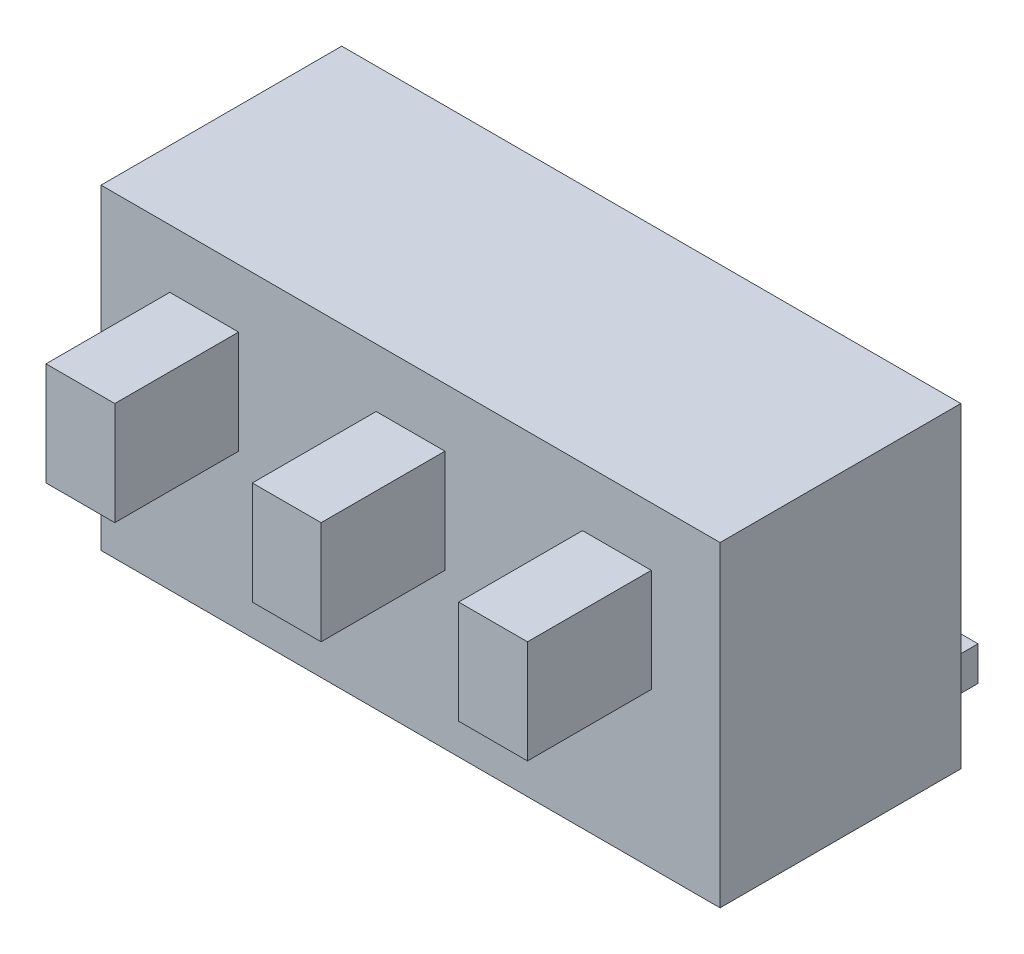
ISO-10303-21;
HEADER;
FILE_DESCRIPTION(('STEP AP214'),'2;1');
FILE_NAME('part.step','',(''),(''),'','','');
FILE_SCHEMA(('AUTOMOTIVE_DESIGN { 1 0 10303 214 1 1 1 1 }'));
ENDSEC;
DATA;
#1=APPLICATION_CONTEXT('core data for automotive mechanical design processes');
#2=APPLICATION_PROTOCOL_DEFINITION('international standard','automotive_design',2000,#1);
#3=PRODUCT_CONTEXT('',#1,'mechanical');
#4=PRODUCT('Part','Part','',(#3));
#5=PRODUCT_RELATED_PRODUCT_CATEGORY('part','',(#4));
#6=PRODUCT_DEFINITION_FORMATION('','',#4);
#7=PRODUCT_DEFINITION_CONTEXT('part definition',#1,'design');
#8=PRODUCT_DEFINITION('design','',#6,#7);
#9=PRODUCT_DEFINITION_SHAPE('','',#8);
#10=(LENGTH_UNIT() NAMED_UNIT(*) SI_UNIT(.MILLI.,.METRE.));
#11=(NAMED_UNIT(*) PLANE_ANGLE_UNIT() SI_UNIT($,.RADIAN.));
#12=(NAMED_UNIT(*) SI_UNIT($,.STERADIAN.) SOLID_ANGLE_UNIT());
#13=UNCERTAINTY_MEASURE_WITH_UNIT(LENGTH_MEASURE(1.E-05),#10,'distance_accuracy_value','');
#14=(GEOMETRIC_REPRESENTATION_CONTEXT(3) GLOBAL_UNCERTAINTY_ASSIGNED_CONTEXT((#13)) GLOBAL_UNIT_ASSIGNED_CONTEXT((#10,
#11,#12)) REPRESENTATION_CONTEXT('',''));
#15=CARTESIAN_POINT('',(0.,0.,0.));
#16=DIRECTION('',(0.,0.,1.));
#17=DIRECTION('',(1.,0.,0.));
#18=AXIS2_PLACEMENT_3D('',#15,#16,#17);
#19=CARTESIAN_POINT('',(-4.50000000000001,4.6,-1.75));
#20=DIRECTION('',(0.,0.,1.));
#21=DIRECTION('',(1.,0.,0.));
#22=AXIS2_PLACEMENT_3D('',#19,#20,#21);
#23=PLANE('',#22);
#24=DIRECTION('',(0.,1.,0.));
#25=VECTOR('',#24,1.);
#26=CARTESIAN_POINT('',(2.45,0.5,-1.75));
#27=LINE('',#26,#25);
#28=CARTESIAN_POINT('',(2.45,0.,-1.75));
#29=VERTEX_POINT('',#28);
#30=CARTESIAN_POINT('',(2.45,0.5,-1.75));
#31=VERTEX_POINT('',#30);
#32=EDGE_CURVE('E239',#29,#31,#27,.T.);
#33=ORIENTED_EDGE('',*,*,#32,.F.);
#34=DIRECTION('',(-1.,0.,0.));
#35=VECTOR('',#34,1.);
#36=CARTESIAN_POINT('',(-4.50000000000001,0.,-1.75));
#37=LINE('',#36,#35);
#38=CARTESIAN_POINT('',(0.55,0.,-1.75));
#39=VERTEX_POINT('',#38);
#40=EDGE_CURVE('E434',#29,#39,#37,.T.);
#41=ORIENTED_EDGE('',*,*,#40,.T.);
#42=DIRECTION('',(0.,-1.,0.));
#43=VECTOR('',#42,1.);
#44=CARTESIAN_POINT('',(0.55,0.5,-1.75));
#45=LINE('',#44,#43);
#46=CARTESIAN_POINT('',(0.55,0.5,-1.75));
#47=VERTEX_POINT('',#46);
#48=EDGE_CURVE('E280',#47,#39,#45,.T.);
#49=ORIENTED_EDGE('',*,*,#48,.F.);
#50=DIRECTION('',(1.,0.,0.));
#51=VECTOR('',#50,1.);
#52=CARTESIAN_POINT('',(0.55,0.5,-1.75));
#53=LINE('',#52,#51);
#54=CARTESIAN_POINT('',(-0.55,0.5,-1.75));
#55=VERTEX_POINT('',#54);
#56=EDGE_CURVE('E289',#55,#47,#53,.T.);
#57=ORIENTED_EDGE('',*,*,#56,.F.);
#58=DIRECTION('',(0.,1.,0.));
#59=VECTOR('',#58,1.);
#60=CARTESIAN_POINT('',(-0.55,0.5,-1.75));
#61=LINE('',#60,#59);
#62=CARTESIAN_POINT('',(-0.55,0.,-1.75));
#63=VERTEX_POINT('',#62);
#64=EDGE_CURVE('E275',#63,#55,#61,.T.);
#65=ORIENTED_EDGE('',*,*,#64,.F.);
#66=CARTESIAN_POINT('',(-2.45,0.,-1.75));
#67=VERTEX_POINT('',#66);
#68=EDGE_CURVE('E435',#63,#67,#37,.T.);
#69=ORIENTED_EDGE('',*,*,#68,.T.);
#70=DIRECTION('',(0.,-1.,0.));
#71=VECTOR('',#70,1.);
#72=CARTESIAN_POINT('',(-2.45,0.5,-1.75));
#73=LINE('',#72,#71);
#74=CARTESIAN_POINT('',(-2.45,0.5,-1.75));
#75=VERTEX_POINT('',#74);
#76=EDGE_CURVE('E253',#75,#67,#73,.T.);
#77=ORIENTED_EDGE('',*,*,#76,.F.);
#78=DIRECTION('',(1.,0.,0.));
#79=VECTOR('',#78,1.);
#80=CARTESIAN_POINT('',(-2.45,0.5,-1.75));
#81=LINE('',#80,#79);
#82=CARTESIAN_POINT('',(-3.55,0.5,-1.75));
#83=VERTEX_POINT('',#82);
#84=EDGE_CURVE('E243',#83,#75,#81,.T.);
#85=ORIENTED_EDGE('',*,*,#84,.F.);
#86=DIRECTION('',(0.,1.,0.));
#87=VECTOR('',#86,1.);
#88=CARTESIAN_POINT('',(-3.55,0.5,-1.75));
#89=LINE('',#88,#87);
#90=CARTESIAN_POINT('',(-3.55,0.,-1.75));
#91=VERTEX_POINT('',#90);
#92=EDGE_CURVE('E240',#91,#83,#89,.T.);
#93=ORIENTED_EDGE('',*,*,#92,.F.);
#94=CARTESIAN_POINT('',(-4.50000000000001,0.,-1.75));
#95=VERTEX_POINT('',#94);
#96=EDGE_CURVE('E430',#91,#95,#37,.T.);
#97=ORIENTED_EDGE('',*,*,#96,.T.);
#98=DIRECTION('',(0.,-1.,0.));
#99=VECTOR('',#98,1.);
#100=CARTESIAN_POINT('',(-4.50000000000001,4.6,-1.75));
#101=LINE('',#100,#99);
#102=CARTESIAN_POINT('',(-4.50000000000001,4.6,-1.75));
#103=VERTEX_POINT('',#102);
#104=EDGE_CURVE('E42',#103,#95,#101,.T.);
#105=ORIENTED_EDGE('',*,*,#104,.F.);
#106=DIRECTION('',(-1.,0.,0.));
#107=VECTOR('',#106,1.);
#108=CARTESIAN_POINT('',(-4.50000000000001,4.6,-1.75));
#109=LINE('',#108,#107);
#110=CARTESIAN_POINT('',(4.49999999999999,4.6,-1.75));
#111=VERTEX_POINT('',#110);
#112=EDGE_CURVE('E420',#111,#103,#109,.T.);
#113=ORIENTED_EDGE('',*,*,#112,.F.);
#114=DIRECTION('',(0.,-1.,0.));
#115=VECTOR('',#114,1.);
#116=CARTESIAN_POINT('',(4.49999999999999,4.6,-1.75));
#117=LINE('',#116,#115);
#118=CARTESIAN_POINT('',(4.49999999999999,0.,-1.75));
#119=VERTEX_POINT('',#118);
#120=EDGE_CURVE('E11',#111,#119,#117,.T.);
#121=ORIENTED_EDGE('',*,*,#120,.T.);
#122=CARTESIAN_POINT('',(3.55,0.,-1.75));
#123=VERTEX_POINT('',#122);
#124=EDGE_CURVE('E431',#119,#123,#37,.T.);
#125=ORIENTED_EDGE('',*,*,#124,.T.);
#126=DIRECTION('',(0.,-1.,0.));
#127=VECTOR('',#126,1.);
#128=CARTESIAN_POINT('',(3.55,0.5,-1.75));
#129=LINE('',#128,#127);
#130=CARTESIAN_POINT('',(3.55,0.5,-1.75));
#131=VERTEX_POINT('',#130);
#132=EDGE_CURVE('E54',#131,#123,#129,.T.);
#133=ORIENTED_EDGE('',*,*,#132,.F.);
#134=DIRECTION('',(1.,0.,0.));
#135=VECTOR('',#134,1.);
#136=CARTESIAN_POINT('',(3.55,0.5,-1.75));
#137=LINE('',#136,#135);
#138=EDGE_CURVE('E49',#31,#131,#137,.T.);
#139=ORIENTED_EDGE('',*,*,#138,.F.);
#140=EDGE_LOOP('',(#33,#41,#49,#57,#65,#69,#77,#85,#93,#97,#105,#113,#121,#125,#133,#139));
#141=FACE_BOUND('',#140,.T.);
#142=ADVANCED_FACE('F34',(#141),#23,.F.);
#143=CARTESIAN_POINT('',(-4.50000000000001,4.6,1.75));
#144=DIRECTION('',(0.,0.,-1.));
#145=DIRECTION('',(-1.,0.,0.));
#146=AXIS2_PLACEMENT_3D('',#143,#144,#145);
#147=PLANE('',#146);
#148=DIRECTION('',(0.,1.,0.));
#149=VECTOR('',#148,1.);
#150=CARTESIAN_POINT('',(3.5,2.25,1.75));
#151=LINE('',#150,#149);
#152=CARTESIAN_POINT('',(3.5,2.25,1.75));
#153=VERTEX_POINT('',#152);
#154=CARTESIAN_POINT('',(3.5,3.75,1.75));
#155=VERTEX_POINT('',#154);
#156=EDGE_CURVE('E380',#153,#155,#151,.T.);
#157=ORIENTED_EDGE('',*,*,#156,.F.);
#158=DIRECTION('',(1.,0.,0.));
#159=VECTOR('',#158,1.);
#160=CARTESIAN_POINT('',(2.5,2.25,1.75));
#161=LINE('',#160,#159);
#162=CARTESIAN_POINT('',(2.5,2.25,1.75));
#163=VERTEX_POINT('',#162);
#164=EDGE_CURVE('E350',#163,#153,#161,.T.);
#165=ORIENTED_EDGE('',*,*,#164,.F.);
#166=DIRECTION('',(0.,-1.,0.));
#167=VECTOR('',#166,1.);
#168=CARTESIAN_POINT('',(2.5,2.25,1.75));
#169=LINE('',#168,#167);
#170=CARTESIAN_POINT('',(2.5,3.75,1.75));
#171=VERTEX_POINT('',#170);
#172=EDGE_CURVE('E368',#171,#163,#169,.T.);
#173=ORIENTED_EDGE('',*,*,#172,.F.);
#174=DIRECTION('',(-1.,0.,0.));
#175=VECTOR('',#174,1.);
#176=CARTESIAN_POINT('',(2.5,3.75,1.75));
#177=LINE('',#176,#175);
#178=EDGE_CURVE('E374',#155,#171,#177,.T.);
#179=ORIENTED_EDGE('',*,*,#178,.F.);
#180=EDGE_LOOP('',(#157,#165,#173,#179));
#181=FACE_BOUND('',#180,.T.);
#182=DIRECTION('',(1.,0.,0.));
#183=VECTOR('',#182,1.);
#184=CARTESIAN_POINT('',(-4.50000000000001,0.,1.75));
#185=LINE('',#184,#183);
#186=CARTESIAN_POINT('',(-4.50000000000001,0.,1.75));
#187=VERTEX_POINT('',#186);
#188=CARTESIAN_POINT('',(4.49999999999999,0.,1.75));
#189=VERTEX_POINT('',#188);
#190=EDGE_CURVE('E421',#187,#189,#185,.T.);
#191=ORIENTED_EDGE('',*,*,#190,.T.);
#192=DIRECTION('',(0.,-1.,0.));
#193=VECTOR('',#192,1.);
#194=CARTESIAN_POINT('',(4.49999999999999,4.6,1.75));
#195=LINE('',#194,#193);
#196=CARTESIAN_POINT('',(4.49999999999999,4.6,1.75));
#197=VERTEX_POINT('',#196);
#198=EDGE_CURVE('E427',#197,#189,#195,.T.);
#199=ORIENTED_EDGE('',*,*,#198,.F.);
#200=DIRECTION('',(1.,0.,0.));
#201=VECTOR('',#200,1.);
#202=CARTESIAN_POINT('',(-4.50000000000001,4.6,1.75));
#203=LINE('',#202,#201);
#204=CARTESIAN_POINT('',(-4.50000000000001,4.6,1.75));
#205=VERTEX_POINT('',#204);
#206=EDGE_CURVE('E425',#205,#197,#203,.T.);
#207=ORIENTED_EDGE('',*,*,#206,.F.);
#208=DIRECTION('',(0.,-1.,0.));
#209=VECTOR('',#208,1.);
#210=CARTESIAN_POINT('',(-4.50000000000001,4.6,1.75));
#211=LINE('',#210,#209);
#212=EDGE_CURVE('E440',#205,#187,#211,.T.);
#213=ORIENTED_EDGE('',*,*,#212,.T.);
#214=EDGE_LOOP('',(#191,#199,#207,#213));
#215=FACE_BOUND('',#214,.T.);
#216=DIRECTION('',(0.,1.,0.));
#217=VECTOR('',#216,1.);
#218=CARTESIAN_POINT('',(0.5,2.25,1.75));
#219=LINE('',#218,#217);
#220=CARTESIAN_POINT('',(0.5,2.25,1.75));
#221=VERTEX_POINT('',#220);
#222=CARTESIAN_POINT('',(0.5,3.75,1.75));
#223=VERTEX_POINT('',#222);
#224=EDGE_CURVE('E383',#221,#223,#219,.T.);
#225=ORIENTED_EDGE('',*,*,#224,.F.);
#226=DIRECTION('',(1.,0.,0.));
#227=VECTOR('',#226,1.);
#228=CARTESIAN_POINT('',(-0.5,2.25,1.75));
#229=LINE('',#228,#227);
#230=CARTESIAN_POINT('',(-0.5,2.25,1.75));
#231=VERTEX_POINT('',#230);
#232=EDGE_CURVE('E388',#231,#221,#229,.T.);
#233=ORIENTED_EDGE('',*,*,#232,.F.);
#234=DIRECTION('',(0.,-1.,0.));
#235=VECTOR('',#234,1.);
#236=CARTESIAN_POINT('',(-0.5,2.25,1.75));
#237=LINE('',#236,#235);
#238=CARTESIAN_POINT('',(-0.499999999999999,3.75,1.75));
#239=VERTEX_POINT('',#238);
#240=EDGE_CURVE('E400',#239,#231,#237,.T.);
#241=ORIENTED_EDGE('',*,*,#240,.F.);
#242=DIRECTION('',(-1.,0.,0.));
#243=VECTOR('',#242,1.);
#244=CARTESIAN_POINT('',(-0.5,3.75,1.75));
#245=LINE('',#244,#243);
#246=EDGE_CURVE('E397',#223,#239,#245,.T.);
#247=ORIENTED_EDGE('',*,*,#246,.F.);
#248=EDGE_LOOP('',(#225,#233,#241,#247));
#249=FACE_BOUND('',#248,.T.);
#250=DIRECTION('',(0.,1.,0.));
#251=VECTOR('',#250,1.);
#252=CARTESIAN_POINT('',(-2.5,2.25,1.75));
#253=LINE('',#252,#251);
#254=CARTESIAN_POINT('',(-2.5,2.25,1.75));
#255=VERTEX_POINT('',#254);
#256=CARTESIAN_POINT('',(-2.5,3.75,1.75));
#257=VERTEX_POINT('',#256);
#258=EDGE_CURVE('E347',#255,#257,#253,.T.);
#259=ORIENTED_EDGE('',*,*,#258,.F.);
#260=DIRECTION('',(1.,0.,0.));
#261=VECTOR('',#260,1.);
#262=CARTESIAN_POINT('',(-3.5,2.25,1.75));
#263=LINE('',#262,#261);
#264=CARTESIAN_POINT('',(-3.5,2.25,1.75));
#265=VERTEX_POINT('',#264);
#266=EDGE_CURVE('E315',#265,#255,#263,.T.);
#267=ORIENTED_EDGE('',*,*,#266,.F.);
#268=DIRECTION('',(0.,-1.,0.));
#269=VECTOR('',#268,1.);
#270=CARTESIAN_POINT('',(-3.5,2.25,1.75));
#271=LINE('',#270,#269);
#272=CARTESIAN_POINT('',(-3.5,3.75,1.75));
#273=VERTEX_POINT('',#272);
#274=EDGE_CURVE('E335',#273,#265,#271,.T.);
#275=ORIENTED_EDGE('',*,*,#274,.F.);
#276=DIRECTION('',(-1.,0.,0.));
#277=VECTOR('',#276,1.);
#278=CARTESIAN_POINT('',(-3.5,3.75,1.75));
#279=LINE('',#278,#277);
#280=EDGE_CURVE('E341',#257,#273,#279,.T.);
#281=ORIENTED_EDGE('',*,*,#280,.F.);
#282=EDGE_LOOP('',(#259,#267,#275,#281));
#283=FACE_BOUND('',#282,.T.);
#284=ADVANCED_FACE('F457',(#181,#215,#249,#283),#147,.F.);
#285=CARTESIAN_POINT('',(4.49999999999999,4.6,1.75));
#286=DIRECTION('',(-1.,0.,0.));
#287=DIRECTION('',(0.,0.,1.));
#288=AXIS2_PLACEMENT_3D('',#285,#286,#287);
#289=PLANE('',#288);
#290=DIRECTION('',(0.,0.,-1.));
#291=VECTOR('',#290,1.);
#292=CARTESIAN_POINT('',(4.49999999999999,0.,1.75));
#293=LINE('',#292,#291);
#294=EDGE_CURVE('E416',#189,#119,#293,.T.);
#295=ORIENTED_EDGE('',*,*,#294,.T.);
#296=ORIENTED_EDGE('',*,*,#120,.F.);
#297=DIRECTION('',(0.,0.,-1.));
#298=VECTOR('',#297,1.);
#299=CARTESIAN_POINT('',(4.49999999999999,4.6,1.75));
#300=LINE('',#299,#298);
#301=EDGE_CURVE('E417',#197,#111,#300,.T.);
#302=ORIENTED_EDGE('',*,*,#301,.F.);
#303=ORIENTED_EDGE('',*,*,#198,.T.);
#304=EDGE_LOOP('',(#295,#296,#302,#303));
#305=FACE_BOUND('',#304,.T.);
#306=ADVANCED_FACE('F36',(#305),#289,.F.);
#307=CARTESIAN_POINT('',(-4.50000000000001,4.6,1.75));
#308=DIRECTION('',(1.,0.,0.));
#309=DIRECTION('',(0.,0.,-1.));
#310=AXIS2_PLACEMENT_3D('',#307,#308,#309);
#311=PLANE('',#310);
#312=DIRECTION('',(0.,0.,1.));
#313=VECTOR('',#312,1.);
#314=CARTESIAN_POINT('',(-4.50000000000001,0.,1.75));
#315=LINE('',#314,#313);
#316=EDGE_CURVE('E433',#95,#187,#315,.T.);
#317=ORIENTED_EDGE('',*,*,#316,.T.);
#318=ORIENTED_EDGE('',*,*,#212,.F.);
#319=DIRECTION('',(0.,0.,1.));
#320=VECTOR('',#319,1.);
#321=CARTESIAN_POINT('',(-4.50000000000001,4.6,1.75));
#322=LINE('',#321,#320);
#323=EDGE_CURVE('E423',#103,#205,#322,.T.);
#324=ORIENTED_EDGE('',*,*,#323,.F.);
#325=ORIENTED_EDGE('',*,*,#104,.T.);
#326=EDGE_LOOP('',(#317,#318,#324,#325));
#327=FACE_BOUND('',#326,.T.);
#328=ADVANCED_FACE('F447',(#327),#311,.F.);
#329=CARTESIAN_POINT('',(0.,4.6,0.));
#330=DIRECTION('',(0.,-1.,0.));
#331=DIRECTION('',(0.,0.,-1.));
#332=AXIS2_PLACEMENT_3D('',#329,#330,#331);
#333=PLANE('',#332);
#334=ORIENTED_EDGE('',*,*,#301,.T.);
#335=ORIENTED_EDGE('',*,*,#112,.T.);
#336=ORIENTED_EDGE('',*,*,#323,.T.);
#337=ORIENTED_EDGE('',*,*,#206,.T.);
#338=EDGE_LOOP('',(#334,#335,#336,#337));
#339=FACE_BOUND('',#338,.T.);
#340=ADVANCED_FACE('F464',(#339),#333,.F.);
#341=CARTESIAN_POINT('',(0.,0.,0.));
#342=DIRECTION('',(0.,-1.,0.));
#343=DIRECTION('',(0.,0.,-1.));
#344=AXIS2_PLACEMENT_3D('',#341,#342,#343);
#345=PLANE('',#344);
#346=CARTESIAN_POINT('',(1.5,0.,-1.15));
#347=DIRECTION('',(0.,-1.,0.));
#348=DIRECTION('',(0.,0.,-1.));
#349=AXIS2_PLACEMENT_3D('',#346,#347,#348);
#350=CIRCLE('',#349,0.35);
#351=CARTESIAN_POINT('',(1.5,0.,-1.5));
#352=VERTEX_POINT('',#351);
#353=EDGE_CURVE('E305',#352,#352,#350,.T.);
#354=ORIENTED_EDGE('',*,*,#353,.F.);
#355=EDGE_LOOP('',(#354));
#356=FACE_BOUND('',#355,.T.);
#357=CARTESIAN_POINT('',(-1.5,0.,-1.15));
#358=DIRECTION('',(0.,-1.,0.));
#359=DIRECTION('',(0.,0.,-1.));
#360=AXIS2_PLACEMENT_3D('',#357,#358,#359);
#361=CIRCLE('',#360,0.35);
#362=CARTESIAN_POINT('',(-1.5,0.,-1.5));
#363=VERTEX_POINT('',#362);
#364=EDGE_CURVE('E309',#363,#363,#361,.T.);
#365=ORIENTED_EDGE('',*,*,#364,.F.);
#366=EDGE_LOOP('',(#365));
#367=FACE_BOUND('',#366,.T.);
#368=ORIENTED_EDGE('',*,*,#294,.F.);
#369=ORIENTED_EDGE('',*,*,#190,.F.);
#370=ORIENTED_EDGE('',*,*,#316,.F.);
#371=ORIENTED_EDGE('',*,*,#96,.F.);
#372=DIRECTION('',(0.,0.,1.));
#373=VECTOR('',#372,1.);
#374=CARTESIAN_POINT('',(-3.55,0.,-2.95));
#375=LINE('',#374,#373);
#376=CARTESIAN_POINT('',(-3.55,0.,-2.95));
#377=VERTEX_POINT('',#376);
#378=EDGE_CURVE('E258',#377,#91,#375,.T.);
#379=ORIENTED_EDGE('',*,*,#378,.F.);
#380=DIRECTION('',(-1.,0.,0.));
#381=VECTOR('',#380,1.);
#382=CARTESIAN_POINT('',(-2.45,0.,-2.95));
#383=LINE('',#382,#381);
#384=CARTESIAN_POINT('',(-2.45,0.,-2.95));
#385=VERTEX_POINT('',#384);
#386=EDGE_CURVE('E257',#385,#377,#383,.T.);
#387=ORIENTED_EDGE('',*,*,#386,.F.);
#388=DIRECTION('',(0.,0.,1.));
#389=VECTOR('',#388,1.);
#390=CARTESIAN_POINT('',(-2.45,0.,-2.95));
#391=LINE('',#390,#389);
#392=EDGE_CURVE('E266',#385,#67,#391,.T.);
#393=ORIENTED_EDGE('',*,*,#392,.T.);
#394=ORIENTED_EDGE('',*,*,#68,.F.);
#395=DIRECTION('',(0.,0.,1.));
#396=VECTOR('',#395,1.);
#397=CARTESIAN_POINT('',(-0.55,0.,-2.95));
#398=LINE('',#397,#396);
#399=CARTESIAN_POINT('',(-0.55,0.,-2.95));
#400=VERTEX_POINT('',#399);
#401=EDGE_CURVE('E286',#400,#63,#398,.T.);
#402=ORIENTED_EDGE('',*,*,#401,.F.);
#403=DIRECTION('',(-1.,0.,0.));
#404=VECTOR('',#403,1.);
#405=CARTESIAN_POINT('',(0.55,0.,-2.95));
#406=LINE('',#405,#404);
#407=CARTESIAN_POINT('',(0.55,0.,-2.95));
#408=VERTEX_POINT('',#407);
#409=EDGE_CURVE('E284',#408,#400,#406,.T.);
#410=ORIENTED_EDGE('',*,*,#409,.F.);
#411=DIRECTION('',(0.,0.,1.));
#412=VECTOR('',#411,1.);
#413=CARTESIAN_POINT('',(0.55,0.,-2.95));
#414=LINE('',#413,#412);
#415=EDGE_CURVE('E296',#408,#39,#414,.T.);
#416=ORIENTED_EDGE('',*,*,#415,.T.);
#417=ORIENTED_EDGE('',*,*,#40,.F.);
#418=DIRECTION('',(0.,0.,1.));
#419=VECTOR('',#418,1.);
#420=CARTESIAN_POINT('',(2.45,0.,-2.95));
#421=LINE('',#420,#419);
#422=CARTESIAN_POINT('',(2.45,0.,-2.95));
#423=VERTEX_POINT('',#422);
#424=EDGE_CURVE('E470',#423,#29,#421,.T.);
#425=ORIENTED_EDGE('',*,*,#424,.F.);
#426=DIRECTION('',(-1.,0.,0.));
#427=VECTOR('',#426,1.);
#428=CARTESIAN_POINT('',(3.55,0.,-2.95));
#429=LINE('',#428,#427);
#430=CARTESIAN_POINT('',(3.55,0.,-2.95));
#431=VERTEX_POINT('',#430);
#432=EDGE_CURVE('E233',#431,#423,#429,.T.);
#433=ORIENTED_EDGE('',*,*,#432,.F.);
#434=DIRECTION('',(0.,0.,1.));
#435=VECTOR('',#434,1.);
#436=CARTESIAN_POINT('',(3.55,0.,-2.95));
#437=LINE('',#436,#435);
#438=EDGE_CURVE('E245',#431,#123,#437,.T.);
#439=ORIENTED_EDGE('',*,*,#438,.T.);
#440=ORIENTED_EDGE('',*,*,#124,.F.);
#441=EDGE_LOOP('',(#368,#369,#370,#371,#379,#387,#393,#394,#402,#410,#416,#417,#425,#433,#439,#440));
#442=FACE_BOUND('',#441,.T.);
#443=ADVANCED_FACE('F452',(#356,#367,#442),#345,.T.);
#444=CARTESIAN_POINT('',(0.5,2.25,3.55));
#445=DIRECTION('',(-1.,0.,0.));
#446=DIRECTION('',(0.,-1.,0.));
#447=AXIS2_PLACEMENT_3D('',#444,#445,#446);
#448=PLANE('',#447);
#449=ORIENTED_EDGE('',*,*,#224,.T.);
#450=DIRECTION('',(0.,0.,-1.));
#451=VECTOR('',#450,1.);
#452=CARTESIAN_POINT('',(0.5,3.75,3.55));
#453=LINE('',#452,#451);
#454=CARTESIAN_POINT('',(0.5,3.75,3.55));
#455=VERTEX_POINT('',#454);
#456=EDGE_CURVE('E413',#455,#223,#453,.T.);
#457=ORIENTED_EDGE('',*,*,#456,.F.);
#458=DIRECTION('',(0.,1.,0.));
#459=VECTOR('',#458,1.);
#460=CARTESIAN_POINT('',(0.5,2.25,3.55));
#461=LINE('',#460,#459);
#462=CARTESIAN_POINT('',(0.5,2.25,3.55));
#463=VERTEX_POINT('',#462);
#464=EDGE_CURVE('E384',#463,#455,#461,.T.);
#465=ORIENTED_EDGE('',*,*,#464,.F.);
#466=DIRECTION('',(0.,0.,-1.));
#467=VECTOR('',#466,1.);
#468=CARTESIAN_POINT('',(0.5,2.25,3.55));
#469=LINE('',#468,#467);
#470=EDGE_CURVE('E394',#463,#221,#469,.T.);
#471=ORIENTED_EDGE('',*,*,#470,.T.);
#472=EDGE_LOOP('',(#449,#457,#465,#471));
#473=FACE_BOUND('',#472,.T.);
#474=ADVANCED_FACE('F513',(#473),#448,.F.);
#475=CARTESIAN_POINT('',(-0.5,3.75,3.55));
#476=DIRECTION('',(0.,-1.,0.));
#477=DIRECTION('',(0.,0.,-1.));
#478=AXIS2_PLACEMENT_3D('',#475,#476,#477);
#479=PLANE('',#478);
#480=ORIENTED_EDGE('',*,*,#246,.T.);
#481=DIRECTION('',(0.,0.,-1.));
#482=VECTOR('',#481,1.);
#483=CARTESIAN_POINT('',(-0.5,3.75,3.55));
#484=LINE('',#483,#482);
#485=CARTESIAN_POINT('',(-0.5,3.75,3.55));
#486=VERTEX_POINT('',#485);
#487=EDGE_CURVE('E410',#486,#239,#484,.T.);
#488=ORIENTED_EDGE('',*,*,#487,.F.);
#489=DIRECTION('',(-1.,0.,0.));
#490=VECTOR('',#489,1.);
#491=CARTESIAN_POINT('',(-0.5,3.75,3.55));
#492=LINE('',#491,#490);
#493=EDGE_CURVE('E387',#455,#486,#492,.T.);
#494=ORIENTED_EDGE('',*,*,#493,.F.);
#495=ORIENTED_EDGE('',*,*,#456,.T.);
#496=EDGE_LOOP('',(#480,#488,#494,#495));
#497=FACE_BOUND('',#496,.T.);
#498=ADVANCED_FACE('F519',(#497),#479,.F.);
#499=CARTESIAN_POINT('',(-0.5,2.25,3.55));
#500=DIRECTION('',(1.,0.,0.));
#501=DIRECTION('',(0.,1.,0.));
#502=AXIS2_PLACEMENT_3D('',#499,#500,#501);
#503=PLANE('',#502);
#504=ORIENTED_EDGE('',*,*,#240,.T.);
#505=DIRECTION('',(0.,0.,-1.));
#506=VECTOR('',#505,1.);
#507=CARTESIAN_POINT('',(-0.5,2.25,3.55));
#508=LINE('',#507,#506);
#509=CARTESIAN_POINT('',(-0.5,2.25,3.55));
#510=VERTEX_POINT('',#509);
#511=EDGE_CURVE('E407',#510,#231,#508,.T.);
#512=ORIENTED_EDGE('',*,*,#511,.F.);
#513=DIRECTION('',(0.,-1.,0.));
#514=VECTOR('',#513,1.);
#515=CARTESIAN_POINT('',(-0.5,2.25,3.55));
#516=LINE('',#515,#514);
#517=EDGE_CURVE('E390',#486,#510,#516,.T.);
#518=ORIENTED_EDGE('',*,*,#517,.F.);
#519=ORIENTED_EDGE('',*,*,#487,.T.);
#520=EDGE_LOOP('',(#504,#512,#518,#519));
#521=FACE_BOUND('',#520,.T.);
#522=ADVANCED_FACE('F523',(#521),#503,.F.);
#523=CARTESIAN_POINT('',(-0.5,2.25,3.55));
#524=DIRECTION('',(0.,1.,0.));
#525=DIRECTION('',(0.,0.,1.));
#526=AXIS2_PLACEMENT_3D('',#523,#524,#525);
#527=PLANE('',#526);
#528=ORIENTED_EDGE('',*,*,#232,.T.);
#529=ORIENTED_EDGE('',*,*,#470,.F.);
#530=DIRECTION('',(1.,0.,0.));
#531=VECTOR('',#530,1.);
#532=CARTESIAN_POINT('',(-0.5,2.25,3.55));
#533=LINE('',#532,#531);
#534=EDGE_CURVE('E392',#510,#463,#533,.T.);
#535=ORIENTED_EDGE('',*,*,#534,.F.);
#536=ORIENTED_EDGE('',*,*,#511,.T.);
#537=EDGE_LOOP('',(#528,#529,#535,#536));
#538=FACE_BOUND('',#537,.T.);
#539=ADVANCED_FACE('F527',(#538),#527,.F.);
#540=CARTESIAN_POINT('',(0.,0.,3.55));
#541=DIRECTION('',(0.,0.,-1.));
#542=DIRECTION('',(-1.,0.,0.));
#543=AXIS2_PLACEMENT_3D('',#540,#541,#542);
#544=PLANE('',#543);
#545=ORIENTED_EDGE('',*,*,#464,.T.);
#546=ORIENTED_EDGE('',*,*,#493,.T.);
#547=ORIENTED_EDGE('',*,*,#517,.T.);
#548=ORIENTED_EDGE('',*,*,#534,.T.);
#549=EDGE_LOOP('',(#545,#546,#547,#548));
#550=FACE_BOUND('',#549,.T.);
#551=ADVANCED_FACE('F531',(#550),#544,.F.);
#552=CARTESIAN_POINT('',(3.5,2.25,3.55));
#553=DIRECTION('',(-1.,0.,0.));
#554=DIRECTION('',(0.,-1.,0.));
#555=AXIS2_PLACEMENT_3D('',#552,#553,#554);
#556=PLANE('',#555);
#557=ORIENTED_EDGE('',*,*,#156,.T.);
#558=DIRECTION('',(0.,0.,-1.));
#559=VECTOR('',#558,1.);
#560=CARTESIAN_POINT('',(3.5,3.75,3.55));
#561=LINE('',#560,#559);
#562=CARTESIAN_POINT('',(3.5,3.75,3.55));
#563=VERTEX_POINT('',#562);
#564=EDGE_CURVE('E377',#563,#155,#561,.T.);
#565=ORIENTED_EDGE('',*,*,#564,.F.);
#566=DIRECTION('',(0.,1.,0.));
#567=VECTOR('',#566,1.);
#568=CARTESIAN_POINT('',(3.5,2.25,3.55));
#569=LINE('',#568,#567);
#570=CARTESIAN_POINT('',(3.5,2.25,3.55));
#571=VERTEX_POINT('',#570);
#572=EDGE_CURVE('E353',#571,#563,#569,.T.);
#573=ORIENTED_EDGE('',*,*,#572,.F.);
#574=DIRECTION('',(0.,0.,-1.));
#575=VECTOR('',#574,1.);
#576=CARTESIAN_POINT('',(3.5,2.25,3.55));
#577=LINE('',#576,#575);
#578=EDGE_CURVE('E362',#571,#153,#577,.T.);
#579=ORIENTED_EDGE('',*,*,#578,.T.);
#580=EDGE_LOOP('',(#557,#565,#573,#579));
#581=FACE_BOUND('',#580,.T.);
#582=ADVANCED_FACE('F535',(#581),#556,.F.);
#583=CARTESIAN_POINT('',(2.5,3.75,3.55));
#584=DIRECTION('',(0.,-1.,0.));
#585=DIRECTION('',(0.,0.,-1.));
#586=AXIS2_PLACEMENT_3D('',#583,#584,#585);
#587=PLANE('',#586);
#588=ORIENTED_EDGE('',*,*,#178,.T.);
#589=DIRECTION('',(0.,0.,-1.));
#590=VECTOR('',#589,1.);
#591=CARTESIAN_POINT('',(2.5,3.75,3.55));
#592=LINE('',#591,#590);
#593=CARTESIAN_POINT('',(2.5,3.75,3.55));
#594=VERTEX_POINT('',#593);
#595=EDGE_CURVE('E371',#594,#171,#592,.T.);
#596=ORIENTED_EDGE('',*,*,#595,.F.);
#597=DIRECTION('',(-1.,0.,0.));
#598=VECTOR('',#597,1.);
#599=CARTESIAN_POINT('',(2.5,3.75,3.55));
#600=LINE('',#599,#598);
#601=EDGE_CURVE('E355',#563,#594,#600,.T.);
#602=ORIENTED_EDGE('',*,*,#601,.F.);
#603=ORIENTED_EDGE('',*,*,#564,.T.);
#604=EDGE_LOOP('',(#588,#596,#602,#603));
#605=FACE_BOUND('',#604,.T.);
#606=ADVANCED_FACE('F539',(#605),#587,.F.);
#607=CARTESIAN_POINT('',(2.5,2.25,3.55));
#608=DIRECTION('',(1.,0.,0.));
#609=DIRECTION('',(0.,1.,0.));
#610=AXIS2_PLACEMENT_3D('',#607,#608,#609);
#611=PLANE('',#610);
#612=ORIENTED_EDGE('',*,*,#172,.T.);
#613=DIRECTION('',(0.,0.,-1.));
#614=VECTOR('',#613,1.);
#615=CARTESIAN_POINT('',(2.5,2.25,3.55));
#616=LINE('',#615,#614);
#617=CARTESIAN_POINT('',(2.5,2.25,3.55));
#618=VERTEX_POINT('',#617);
#619=EDGE_CURVE('E365',#618,#163,#616,.T.);
#620=ORIENTED_EDGE('',*,*,#619,.F.);
#621=DIRECTION('',(0.,-1.,0.));
#622=VECTOR('',#621,1.);
#623=CARTESIAN_POINT('',(2.5,2.25,3.55));
#624=LINE('',#623,#622);
#625=EDGE_CURVE('E357',#594,#618,#624,.T.);
#626=ORIENTED_EDGE('',*,*,#625,.F.);
#627=ORIENTED_EDGE('',*,*,#595,.T.);
#628=EDGE_LOOP('',(#612,#620,#626,#627));
#629=FACE_BOUND('',#628,.T.);
#630=ADVANCED_FACE('F543',(#629),#611,.F.);
#631=CARTESIAN_POINT('',(2.5,2.25,3.55));
#632=DIRECTION('',(0.,1.,0.));
#633=DIRECTION('',(0.,0.,1.));
#634=AXIS2_PLACEMENT_3D('',#631,#632,#633);
#635=PLANE('',#634);
#636=ORIENTED_EDGE('',*,*,#164,.T.);
#637=ORIENTED_EDGE('',*,*,#578,.F.);
#638=DIRECTION('',(1.,0.,0.));
#639=VECTOR('',#638,1.);
#640=CARTESIAN_POINT('',(2.5,2.25,3.55));
#641=LINE('',#640,#639);
#642=EDGE_CURVE('E359',#618,#571,#641,.T.);
#643=ORIENTED_EDGE('',*,*,#642,.F.);
#644=ORIENTED_EDGE('',*,*,#619,.T.);
#645=EDGE_LOOP('',(#636,#637,#643,#644));
#646=FACE_BOUND('',#645,.T.);
#647=ADVANCED_FACE('F547',(#646),#635,.F.);
#648=CARTESIAN_POINT('',(3.,0.,3.55));
#649=DIRECTION('',(0.,0.,-1.));
#650=DIRECTION('',(-1.,0.,0.));
#651=AXIS2_PLACEMENT_3D('',#648,#649,#650);
#652=PLANE('',#651);
#653=ORIENTED_EDGE('',*,*,#572,.T.);
#654=ORIENTED_EDGE('',*,*,#601,.T.);
#655=ORIENTED_EDGE('',*,*,#625,.T.);
#656=ORIENTED_EDGE('',*,*,#642,.T.);
#657=EDGE_LOOP('',(#653,#654,#655,#656));
#658=FACE_BOUND('',#657,.T.);
#659=ADVANCED_FACE('F551',(#658),#652,.F.);
#660=CARTESIAN_POINT('',(-2.5,2.25,3.55));
#661=DIRECTION('',(-1.,0.,0.));
#662=DIRECTION('',(0.,-1.,0.));
#663=AXIS2_PLACEMENT_3D('',#660,#661,#662);
#664=PLANE('',#663);
#665=ORIENTED_EDGE('',*,*,#258,.T.);
#666=DIRECTION('',(0.,0.,-1.));
#667=VECTOR('',#666,1.);
#668=CARTESIAN_POINT('',(-2.5,3.75,3.55));
#669=LINE('',#668,#667);
#670=CARTESIAN_POINT('',(-2.5,3.75,3.55));
#671=VERTEX_POINT('',#670);
#672=EDGE_CURVE('E344',#671,#257,#669,.T.);
#673=ORIENTED_EDGE('',*,*,#672,.F.);
#674=DIRECTION('',(0.,1.,0.));
#675=VECTOR('',#674,1.);
#676=CARTESIAN_POINT('',(-2.5,2.25,3.55));
#677=LINE('',#676,#675);
#678=CARTESIAN_POINT('',(-2.5,2.25,3.55));
#679=VERTEX_POINT('',#678);
#680=EDGE_CURVE('E320',#679,#671,#677,.T.);
#681=ORIENTED_EDGE('',*,*,#680,.F.);
#682=DIRECTION('',(0.,0.,-1.));
#683=VECTOR('',#682,1.);
#684=CARTESIAN_POINT('',(-2.5,2.25,3.55));
#685=LINE('',#684,#683);
#686=EDGE_CURVE('E329',#679,#255,#685,.T.);
#687=ORIENTED_EDGE('',*,*,#686,.T.);
#688=EDGE_LOOP('',(#665,#673,#681,#687));
#689=FACE_BOUND('',#688,.T.);
#690=ADVANCED_FACE('F555',(#689),#664,.F.);
#691=CARTESIAN_POINT('',(-3.5,3.75,3.55));
#692=DIRECTION('',(0.,-1.,0.));
#693=DIRECTION('',(0.,0.,-1.));
#694=AXIS2_PLACEMENT_3D('',#691,#692,#693);
#695=PLANE('',#694);
#696=ORIENTED_EDGE('',*,*,#280,.T.);
#697=DIRECTION('',(0.,0.,-1.));
#698=VECTOR('',#697,1.);
#699=CARTESIAN_POINT('',(-3.5,3.75,3.55));
#700=LINE('',#699,#698);
#701=CARTESIAN_POINT('',(-3.5,3.75,3.55));
#702=VERTEX_POINT('',#701);
#703=EDGE_CURVE('E338',#702,#273,#700,.T.);
#704=ORIENTED_EDGE('',*,*,#703,.F.);
#705=DIRECTION('',(-1.,0.,0.));
#706=VECTOR('',#705,1.);
#707=CARTESIAN_POINT('',(-3.5,3.75,3.55));
#708=LINE('',#707,#706);
#709=EDGE_CURVE('E322',#671,#702,#708,.T.);
#710=ORIENTED_EDGE('',*,*,#709,.F.);
#711=ORIENTED_EDGE('',*,*,#672,.T.);
#712=EDGE_LOOP('',(#696,#704,#710,#711));
#713=FACE_BOUND('',#712,.T.);
#714=ADVANCED_FACE('F559',(#713),#695,.F.);
#715=CARTESIAN_POINT('',(-3.5,2.25,3.55));
#716=DIRECTION('',(1.,0.,0.));
#717=DIRECTION('',(0.,1.,0.));
#718=AXIS2_PLACEMENT_3D('',#715,#716,#717);
#719=PLANE('',#718);
#720=ORIENTED_EDGE('',*,*,#274,.T.);
#721=DIRECTION('',(0.,0.,-1.));
#722=VECTOR('',#721,1.);
#723=CARTESIAN_POINT('',(-3.5,2.25,3.55));
#724=LINE('',#723,#722);
#725=CARTESIAN_POINT('',(-3.5,2.25,3.55));
#726=VERTEX_POINT('',#725);
#727=EDGE_CURVE('E332',#726,#265,#724,.T.);
#728=ORIENTED_EDGE('',*,*,#727,.F.);
#729=DIRECTION('',(0.,-1.,0.));
#730=VECTOR('',#729,1.);
#731=CARTESIAN_POINT('',(-3.5,2.25,3.55));
#732=LINE('',#731,#730);
#733=EDGE_CURVE('E324',#702,#726,#732,.T.);
#734=ORIENTED_EDGE('',*,*,#733,.F.);
#735=ORIENTED_EDGE('',*,*,#703,.T.);
#736=EDGE_LOOP('',(#720,#728,#734,#735));
#737=FACE_BOUND('',#736,.T.);
#738=ADVANCED_FACE('F563',(#737),#719,.F.);
#739=CARTESIAN_POINT('',(-3.5,2.25,3.55));
#740=DIRECTION('',(0.,1.,0.));
#741=DIRECTION('',(0.,0.,1.));
#742=AXIS2_PLACEMENT_3D('',#739,#740,#741);
#743=PLANE('',#742);
#744=ORIENTED_EDGE('',*,*,#266,.T.);
#745=ORIENTED_EDGE('',*,*,#686,.F.);
#746=DIRECTION('',(1.,0.,0.));
#747=VECTOR('',#746,1.);
#748=CARTESIAN_POINT('',(-3.5,2.25,3.55));
#749=LINE('',#748,#747);
#750=EDGE_CURVE('E326',#726,#679,#749,.T.);
#751=ORIENTED_EDGE('',*,*,#750,.F.);
#752=ORIENTED_EDGE('',*,*,#727,.T.);
#753=EDGE_LOOP('',(#744,#745,#751,#752));
#754=FACE_BOUND('',#753,.T.);
#755=ADVANCED_FACE('F567',(#754),#743,.F.);
#756=CARTESIAN_POINT('',(-3.,0.,3.55));
#757=DIRECTION('',(0.,0.,-1.));
#758=DIRECTION('',(-1.,0.,0.));
#759=AXIS2_PLACEMENT_3D('',#756,#757,#758);
#760=PLANE('',#759);
#761=ORIENTED_EDGE('',*,*,#680,.T.);
#762=ORIENTED_EDGE('',*,*,#709,.T.);
#763=ORIENTED_EDGE('',*,*,#733,.T.);
#764=ORIENTED_EDGE('',*,*,#750,.T.);
#765=EDGE_LOOP('',(#761,#762,#763,#764));
#766=FACE_BOUND('',#765,.T.);
#767=ADVANCED_FACE('F571',(#766),#760,.F.);
#768=CARTESIAN_POINT('',(-1.5,-0.7,-1.15));
#769=DIRECTION('',(0.,1.,0.));
#770=DIRECTION('',(0.,0.,1.));
#771=AXIS2_PLACEMENT_3D('',#768,#769,#770);
#772=CYLINDRICAL_SURFACE('',#771,0.35);
#773=CARTESIAN_POINT('',(-1.5,-0.7,-1.15));
#774=DIRECTION('',(0.,-1.,0.));
#775=DIRECTION('',(0.,0.,-1.));
#776=AXIS2_PLACEMENT_3D('',#773,#774,#775);
#777=CIRCLE('',#776,0.35);
#778=CARTESIAN_POINT('',(-1.5,-0.7,-1.5));
#779=VERTEX_POINT('',#778);
#780=EDGE_CURVE('E312',#779,#779,#777,.T.);
#781=ORIENTED_EDGE('',*,*,#780,.F.);
#782=EDGE_LOOP('',(#781));
#783=FACE_BOUND('',#782,.T.);
#784=ORIENTED_EDGE('',*,*,#364,.T.);
#785=EDGE_LOOP('',(#784));
#786=FACE_BOUND('',#785,.T.);
#787=ADVANCED_FACE('F575',(#783,#786),#772,.T.);
#788=CARTESIAN_POINT('',(-1.5,-0.7,-1.15));
#789=DIRECTION('',(0.,-1.,0.));
#790=DIRECTION('',(0.,0.,-1.));
#791=AXIS2_PLACEMENT_3D('',#788,#789,#790);
#792=PLANE('',#791);
#793=ORIENTED_EDGE('',*,*,#780,.T.);
#794=EDGE_LOOP('',(#793));
#795=FACE_BOUND('',#794,.T.);
#796=ADVANCED_FACE('F579',(#795),#792,.T.);
#797=CARTESIAN_POINT('',(1.5,-0.7,-1.15));
#798=DIRECTION('',(0.,1.,0.));
#799=DIRECTION('',(0.,0.,1.));
#800=AXIS2_PLACEMENT_3D('',#797,#798,#799);
#801=CYLINDRICAL_SURFACE('',#800,0.35);
#802=CARTESIAN_POINT('',(1.5,-0.7,-1.15));
#803=DIRECTION('',(0.,-1.,0.));
#804=DIRECTION('',(0.,0.,-1.));
#805=AXIS2_PLACEMENT_3D('',#802,#803,#804);
#806=CIRCLE('',#805,0.35);
#807=CARTESIAN_POINT('',(1.5,-0.7,-1.5));
#808=VERTEX_POINT('',#807);
#809=EDGE_CURVE('E306',#808,#808,#806,.T.);
#810=ORIENTED_EDGE('',*,*,#809,.F.);
#811=EDGE_LOOP('',(#810));
#812=FACE_BOUND('',#811,.T.);
#813=ORIENTED_EDGE('',*,*,#353,.T.);
#814=EDGE_LOOP('',(#813));
#815=FACE_BOUND('',#814,.T.);
#816=ADVANCED_FACE('F583',(#812,#815),#801,.T.);
#817=CARTESIAN_POINT('',(1.5,-0.7,-1.15));
#818=DIRECTION('',(0.,-1.,0.));
#819=DIRECTION('',(0.,0.,-1.));
#820=AXIS2_PLACEMENT_3D('',#817,#818,#819);
#821=PLANE('',#820);
#822=ORIENTED_EDGE('',*,*,#809,.T.);
#823=EDGE_LOOP('',(#822));
#824=FACE_BOUND('',#823,.T.);
#825=ADVANCED_FACE('F587',(#824),#821,.T.);
#826=CARTESIAN_POINT('',(-0.55,0.5,-2.95));
#827=DIRECTION('',(1.,0.,0.));
#828=DIRECTION('',(0.,1.,0.));
#829=AXIS2_PLACEMENT_3D('',#826,#827,#828);
#830=PLANE('',#829);
#831=ORIENTED_EDGE('',*,*,#64,.T.);
#832=DIRECTION('',(0.,0.,1.));
#833=VECTOR('',#832,1.);
#834=CARTESIAN_POINT('',(-0.55,0.5,-2.95));
#835=LINE('',#834,#833);
#836=CARTESIAN_POINT('',(-0.55,0.5,-2.95));
#837=VERTEX_POINT('',#836);
#838=EDGE_CURVE('E302',#837,#55,#835,.T.);
#839=ORIENTED_EDGE('',*,*,#838,.F.);
#840=DIRECTION('',(0.,1.,0.));
#841=VECTOR('',#840,1.);
#842=CARTESIAN_POINT('',(-0.55,0.5,-2.95));
#843=LINE('',#842,#841);
#844=EDGE_CURVE('E276',#400,#837,#843,.T.);
#845=ORIENTED_EDGE('',*,*,#844,.F.);
#846=ORIENTED_EDGE('',*,*,#401,.T.);
#847=EDGE_LOOP('',(#831,#839,#845,#846));
#848=FACE_BOUND('',#847,.T.);
#849=ADVANCED_FACE('F591',(#848),#830,.F.);
#850=CARTESIAN_POINT('',(0.55,0.5,-2.95));
#851=DIRECTION('',(0.,-1.,0.));
#852=DIRECTION('',(0.,0.,-1.));
#853=AXIS2_PLACEMENT_3D('',#850,#851,#852);
#854=PLANE('',#853);
#855=ORIENTED_EDGE('',*,*,#56,.T.);
#856=DIRECTION('',(0.,0.,1.));
#857=VECTOR('',#856,1.);
#858=CARTESIAN_POINT('',(0.55,0.5,-2.95));
#859=LINE('',#858,#857);
#860=CARTESIAN_POINT('',(0.55,0.5,-2.95));
#861=VERTEX_POINT('',#860);
#862=EDGE_CURVE('E299',#861,#47,#859,.T.);
#863=ORIENTED_EDGE('',*,*,#862,.F.);
#864=DIRECTION('',(1.,0.,0.));
#865=VECTOR('',#864,1.);
#866=CARTESIAN_POINT('',(0.55,0.5,-2.95));
#867=LINE('',#866,#865);
#868=EDGE_CURVE('E279',#837,#861,#867,.T.);
#869=ORIENTED_EDGE('',*,*,#868,.F.);
#870=ORIENTED_EDGE('',*,*,#838,.T.);
#871=EDGE_LOOP('',(#855,#863,#869,#870));
#872=FACE_BOUND('',#871,.T.);
#873=ADVANCED_FACE('F595',(#872),#854,.F.);
#874=CARTESIAN_POINT('',(0.55,0.5,-2.95));
#875=DIRECTION('',(-1.,0.,0.));
#876=DIRECTION('',(0.,0.,1.));
#877=AXIS2_PLACEMENT_3D('',#874,#875,#876);
#878=PLANE('',#877);
#879=ORIENTED_EDGE('',*,*,#48,.T.);
#880=ORIENTED_EDGE('',*,*,#415,.F.);
#881=DIRECTION('',(0.,-1.,0.));
#882=VECTOR('',#881,1.);
#883=CARTESIAN_POINT('',(0.55,0.5,-2.95));
#884=LINE('',#883,#882);
#885=EDGE_CURVE('E282',#861,#408,#884,.T.);
#886=ORIENTED_EDGE('',*,*,#885,.F.);
#887=ORIENTED_EDGE('',*,*,#862,.T.);
#888=EDGE_LOOP('',(#879,#880,#886,#887));
#889=FACE_BOUND('',#888,.T.);
#890=ADVANCED_FACE('F599',(#889),#878,.F.);
#891=CARTESIAN_POINT('',(0.,0.,-2.95));
#892=DIRECTION('',(0.,0.,-1.));
#893=DIRECTION('',(-1.,0.,0.));
#894=AXIS2_PLACEMENT_3D('',#891,#892,#893);
#895=PLANE('',#894);
#896=ORIENTED_EDGE('',*,*,#844,.T.);
#897=ORIENTED_EDGE('',*,*,#868,.T.);
#898=ORIENTED_EDGE('',*,*,#885,.T.);
#899=ORIENTED_EDGE('',*,*,#409,.T.);
#900=EDGE_LOOP('',(#896,#897,#898,#899));
#901=FACE_BOUND('',#900,.T.);
#902=ADVANCED_FACE('F500',(#901),#895,.T.);
#903=CARTESIAN_POINT('',(-3.55,0.5,-2.95));
#904=DIRECTION('',(1.,0.,0.));
#905=DIRECTION('',(0.,1.,0.));
#906=AXIS2_PLACEMENT_3D('',#903,#904,#905);
#907=PLANE('',#906);
#908=ORIENTED_EDGE('',*,*,#92,.T.);
#909=DIRECTION('',(0.,0.,1.));
#910=VECTOR('',#909,1.);
#911=CARTESIAN_POINT('',(-3.55,0.5,-2.95));
#912=LINE('',#911,#910);
#913=CARTESIAN_POINT('',(-3.55,0.5,-2.95));
#914=VERTEX_POINT('',#913);
#915=EDGE_CURVE('E272',#914,#83,#912,.T.);
#916=ORIENTED_EDGE('',*,*,#915,.F.);
#917=DIRECTION('',(0.,1.,0.));
#918=VECTOR('',#917,1.);
#919=CARTESIAN_POINT('',(-3.55,0.5,-2.95));
#920=LINE('',#919,#918);
#921=EDGE_CURVE('E249',#377,#914,#920,.T.);
#922=ORIENTED_EDGE('',*,*,#921,.F.);
#923=ORIENTED_EDGE('',*,*,#378,.T.);
#924=EDGE_LOOP('',(#908,#916,#922,#923));
#925=FACE_BOUND('',#924,.T.);
#926=ADVANCED_FACE('F481',(#925),#907,.F.);
#927=CARTESIAN_POINT('',(-2.45,0.5,-2.95));
#928=DIRECTION('',(0.,-1.,0.));
#929=DIRECTION('',(0.,0.,-1.));
#930=AXIS2_PLACEMENT_3D('',#927,#928,#929);
#931=PLANE('',#930);
#932=ORIENTED_EDGE('',*,*,#84,.T.);
#933=DIRECTION('',(0.,0.,1.));
#934=VECTOR('',#933,1.);
#935=CARTESIAN_POINT('',(-2.45,0.5,-2.95));
#936=LINE('',#935,#934);
#937=CARTESIAN_POINT('',(-2.45,0.5,-2.95));
#938=VERTEX_POINT('',#937);
#939=EDGE_CURVE('E269',#938,#75,#936,.T.);
#940=ORIENTED_EDGE('',*,*,#939,.F.);
#941=DIRECTION('',(1.,0.,0.));
#942=VECTOR('',#941,1.);
#943=CARTESIAN_POINT('',(-2.45,0.5,-2.95));
#944=LINE('',#943,#942);
#945=EDGE_CURVE('E252',#914,#938,#944,.T.);
#946=ORIENTED_EDGE('',*,*,#945,.F.);
#947=ORIENTED_EDGE('',*,*,#915,.T.);
#948=EDGE_LOOP('',(#932,#940,#946,#947));
#949=FACE_BOUND('',#948,.T.);
#950=ADVANCED_FACE('F492',(#949),#931,.F.);
#951=CARTESIAN_POINT('',(-2.45,0.5,-2.95));
#952=DIRECTION('',(-1.,0.,0.));
#953=DIRECTION('',(0.,0.,1.));
#954=AXIS2_PLACEMENT_3D('',#951,#952,#953);
#955=PLANE('',#954);
#956=ORIENTED_EDGE('',*,*,#76,.T.);
#957=ORIENTED_EDGE('',*,*,#392,.F.);
#958=DIRECTION('',(0.,-1.,0.));
#959=VECTOR('',#958,1.);
#960=CARTESIAN_POINT('',(-2.45,0.5,-2.95));
#961=LINE('',#960,#959);
#962=EDGE_CURVE('E255',#938,#385,#961,.T.);
#963=ORIENTED_EDGE('',*,*,#962,.F.);
#964=ORIENTED_EDGE('',*,*,#939,.T.);
#965=EDGE_LOOP('',(#956,#957,#963,#964));
#966=FACE_BOUND('',#965,.T.);
#967=ADVANCED_FACE('F490',(#966),#955,.F.);
#968=CARTESIAN_POINT('',(-3.,0.,-2.95));
#969=DIRECTION('',(0.,0.,-1.));
#970=DIRECTION('',(-1.,0.,0.));
#971=AXIS2_PLACEMENT_3D('',#968,#969,#970);
#972=PLANE('',#971);
#973=ORIENTED_EDGE('',*,*,#921,.T.);
#974=ORIENTED_EDGE('',*,*,#945,.T.);
#975=ORIENTED_EDGE('',*,*,#962,.T.);
#976=ORIENTED_EDGE('',*,*,#386,.T.);
#977=EDGE_LOOP('',(#973,#974,#975,#976));
#978=FACE_BOUND('',#977,.T.);
#979=ADVANCED_FACE('F486',(#978),#972,.T.);
#980=CARTESIAN_POINT('',(2.45,0.5,-2.95));
#981=DIRECTION('',(1.,0.,0.));
#982=DIRECTION('',(0.,1.,0.));
#983=AXIS2_PLACEMENT_3D('',#980,#981,#982);
#984=PLANE('',#983);
#985=ORIENTED_EDGE('',*,*,#32,.T.);
#986=DIRECTION('',(0.,0.,1.));
#987=VECTOR('',#986,1.);
#988=CARTESIAN_POINT('',(2.45,0.5,-2.95));
#989=LINE('',#988,#987);
#990=CARTESIAN_POINT('',(2.45,0.5,-2.95));
#991=VERTEX_POINT('',#990);
#992=EDGE_CURVE('E221',#991,#31,#989,.T.);
#993=ORIENTED_EDGE('',*,*,#992,.F.);
#994=DIRECTION('',(0.,1.,0.));
#995=VECTOR('',#994,1.);
#996=CARTESIAN_POINT('',(2.45,0.5,-2.95));
#997=LINE('',#996,#995);
#998=EDGE_CURVE('E228',#423,#991,#997,.T.);
#999=ORIENTED_EDGE('',*,*,#998,.F.);
#1000=ORIENTED_EDGE('',*,*,#424,.T.);
#1001=EDGE_LOOP('',(#985,#993,#999,#1000));
#1002=FACE_BOUND('',#1001,.T.);
#1003=ADVANCED_FACE('F238',(#1002),#984,.F.);
#1004=CARTESIAN_POINT('',(3.55,0.5,-2.95));
#1005=DIRECTION('',(0.,-1.,0.));
#1006=DIRECTION('',(0.,0.,-1.));
#1007=AXIS2_PLACEMENT_3D('',#1004,#1005,#1006);
#1008=PLANE('',#1007);
#1009=ORIENTED_EDGE('',*,*,#138,.T.);
#1010=DIRECTION('',(0.,0.,1.));
#1011=VECTOR('',#1010,1.);
#1012=CARTESIAN_POINT('',(3.55,0.5,-2.95));
#1013=LINE('',#1012,#1011);
#1014=CARTESIAN_POINT('',(3.55,0.5,-2.95));
#1015=VERTEX_POINT('',#1014);
#1016=EDGE_CURVE('E224',#1015,#131,#1013,.T.);
#1017=ORIENTED_EDGE('',*,*,#1016,.F.);
#1018=DIRECTION('',(1.,0.,0.));
#1019=VECTOR('',#1018,1.);
#1020=CARTESIAN_POINT('',(3.55,0.5,-2.95));
#1021=LINE('',#1020,#1019);
#1022=EDGE_CURVE('E217',#991,#1015,#1021,.T.);
#1023=ORIENTED_EDGE('',*,*,#1022,.F.);
#1024=ORIENTED_EDGE('',*,*,#992,.T.);
#1025=EDGE_LOOP('',(#1009,#1017,#1023,#1024));
#1026=FACE_BOUND('',#1025,.T.);
#1027=ADVANCED_FACE('F219',(#1026),#1008,.F.);
#1028=CARTESIAN_POINT('',(3.55,0.5,-2.95));
#1029=DIRECTION('',(-1.,0.,0.));
#1030=DIRECTION('',(0.,0.,1.));
#1031=AXIS2_PLACEMENT_3D('',#1028,#1029,#1030);
#1032=PLANE('',#1031);
#1033=ORIENTED_EDGE('',*,*,#132,.T.);
#1034=ORIENTED_EDGE('',*,*,#438,.F.);
#1035=DIRECTION('',(0.,-1.,0.));
#1036=VECTOR('',#1035,1.);
#1037=CARTESIAN_POINT('',(3.55,0.5,-2.95));
#1038=LINE('',#1037,#1036);
#1039=EDGE_CURVE('E227',#1015,#431,#1038,.T.);
#1040=ORIENTED_EDGE('',*,*,#1039,.F.);
#1041=ORIENTED_EDGE('',*,*,#1016,.T.);
#1042=EDGE_LOOP('',(#1033,#1034,#1040,#1041));
#1043=FACE_BOUND('',#1042,.T.);
#1044=ADVANCED_FACE('F468',(#1043),#1032,.F.);
#1045=CARTESIAN_POINT('',(3.,0.,-2.95));
#1046=DIRECTION('',(0.,0.,-1.));
#1047=DIRECTION('',(-1.,0.,0.));
#1048=AXIS2_PLACEMENT_3D('',#1045,#1046,#1047);
#1049=PLANE('',#1048);
#1050=ORIENTED_EDGE('',*,*,#998,.T.);
#1051=ORIENTED_EDGE('',*,*,#1022,.T.);
#1052=ORIENTED_EDGE('',*,*,#1039,.T.);
#1053=ORIENTED_EDGE('',*,*,#432,.T.);
#1054=EDGE_LOOP('',(#1050,#1051,#1052,#1053));
#1055=FACE_BOUND('',#1054,.T.);
#1056=ADVANCED_FACE('F231',(#1055),#1049,.T.);
#1057=CLOSED_SHELL('',(#142,#284,#306,#328,#340,#443,#474,#498,#522,#539,#551,#582,#606,#630,
#647,#659,#690,#714,#738,#755,#767,#787,#796,#816,#825,#849,#873,#890,#902,#926,#950,#967,#979,
#1003,#1027,#1044,#1056));
#1058=MANIFOLD_SOLID_BREP('B2',#1057);
#1059=ADVANCED_BREP_SHAPE_REPRESENTATION('',(#18,#1058),#14);
#1060=SHAPE_DEFINITION_REPRESENTATION(#9,#1059);
ENDSEC;
END-ISO-10303-21;
